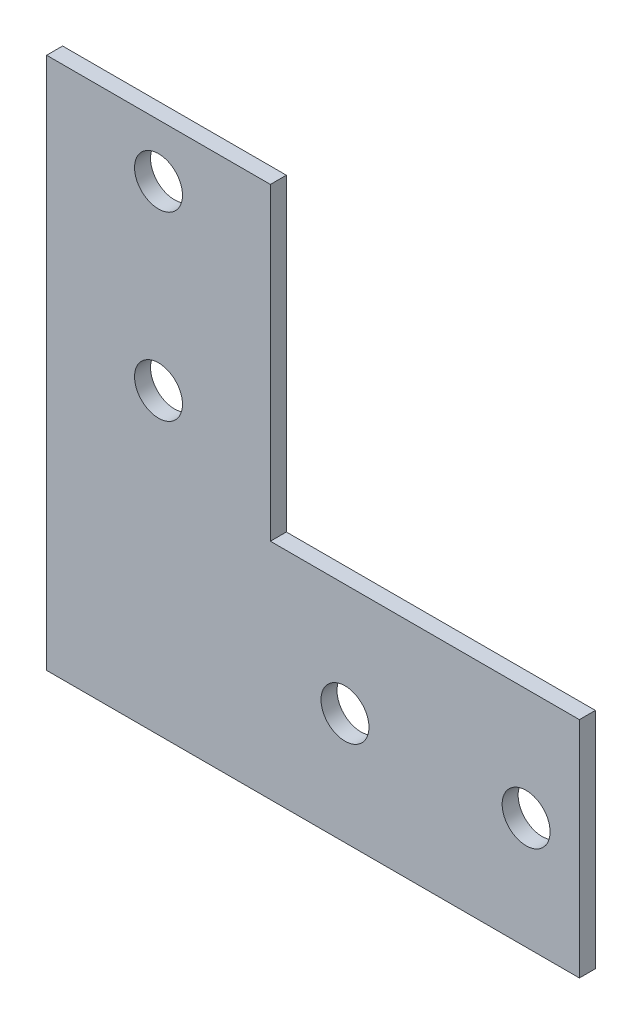
ISO-10303-21;
HEADER;
FILE_DESCRIPTION(('STEP AP214'),'2;1');
FILE_NAME('part.step','',(''),(''),'','','');
FILE_SCHEMA(('AUTOMOTIVE_DESIGN { 1 0 10303 214 1 1 1 1 }'));
ENDSEC;
DATA;
#1=APPLICATION_CONTEXT('core data for automotive mechanical design processes');
#2=APPLICATION_PROTOCOL_DEFINITION('international standard','automotive_design',2000,#1);
#3=PRODUCT_CONTEXT('',#1,'mechanical');
#4=PRODUCT('Part','Part','',(#3));
#5=PRODUCT_RELATED_PRODUCT_CATEGORY('part','',(#4));
#6=PRODUCT_DEFINITION_FORMATION('','',#4);
#7=PRODUCT_DEFINITION_CONTEXT('part definition',#1,'design');
#8=PRODUCT_DEFINITION('design','',#6,#7);
#9=PRODUCT_DEFINITION_SHAPE('','',#8);
#10=(LENGTH_UNIT() NAMED_UNIT(*) SI_UNIT(.MILLI.,.METRE.));
#11=(NAMED_UNIT(*) PLANE_ANGLE_UNIT() SI_UNIT($,.RADIAN.));
#12=(NAMED_UNIT(*) SI_UNIT($,.STERADIAN.) SOLID_ANGLE_UNIT());
#13=UNCERTAINTY_MEASURE_WITH_UNIT(LENGTH_MEASURE(1.E-05),#10,'distance_accuracy_value','');
#14=(GEOMETRIC_REPRESENTATION_CONTEXT(3) GLOBAL_UNCERTAINTY_ASSIGNED_CONTEXT((#13)) GLOBAL_UNIT_ASSIGNED_CONTEXT((#10,
#11,#12)) REPRESENTATION_CONTEXT('',''));
#15=CARTESIAN_POINT('',(0.,0.,0.));
#16=DIRECTION('',(0.,0.,1.));
#17=DIRECTION('',(1.,0.,0.));
#18=AXIS2_PLACEMENT_3D('',#15,#16,#17);
#19=CARTESIAN_POINT('',(0.,0.,3.));
#20=DIRECTION('',(0.,0.,1.));
#21=DIRECTION('',(1.,0.,0.));
#22=AXIS2_PLACEMENT_3D('',#19,#20,#21);
#23=PLANE('',#22);
#24=CARTESIAN_POINT('',(56.,21.,3.));
#25=DIRECTION('',(0.,0.,1.));
#26=DIRECTION('',(1.,0.,0.));
#27=AXIS2_PLACEMENT_3D('',#24,#25,#26);
#28=CIRCLE('',#27,4.5);
#29=CARTESIAN_POINT('',(60.5,21.,3.));
#30=VERTEX_POINT('',#29);
#31=EDGE_CURVE('E190',#30,#30,#28,.T.);
#32=ORIENTED_EDGE('',*,*,#31,.F.);
#33=EDGE_LOOP('',(#32));
#34=FACE_BOUND('',#33,.T.);
#35=CARTESIAN_POINT('',(21.,90.,3.));
#36=DIRECTION('',(0.,0.,1.));
#37=DIRECTION('',(1.,0.,0.));
#38=AXIS2_PLACEMENT_3D('',#35,#36,#37);
#39=CIRCLE('',#38,4.50000000000001);
#40=CARTESIAN_POINT('',(25.5,90.,3.));
#41=VERTEX_POINT('',#40);
#42=EDGE_CURVE('E123',#41,#41,#39,.T.);
#43=ORIENTED_EDGE('',*,*,#42,.F.);
#44=EDGE_LOOP('',(#43));
#45=FACE_BOUND('',#44,.T.);
#46=DIRECTION('',(-1.,0.,0.));
#47=VECTOR('',#46,1.);
#48=CARTESIAN_POINT('',(42.,100.,3.));
#49=LINE('',#48,#47);
#50=CARTESIAN_POINT('',(42.,100.,3.));
#51=VERTEX_POINT('',#50);
#52=CARTESIAN_POINT('',(0.,100.,3.));
#53=VERTEX_POINT('',#52);
#54=EDGE_CURVE('E130',#51,#53,#49,.T.);
#55=ORIENTED_EDGE('',*,*,#54,.T.);
#56=DIRECTION('',(0.,-1.,0.));
#57=VECTOR('',#56,1.);
#58=CARTESIAN_POINT('',(0.,100.,3.));
#59=LINE('',#58,#57);
#60=CARTESIAN_POINT('',(0.,0.,3.));
#61=VERTEX_POINT('',#60);
#62=EDGE_CURVE('E88',#53,#61,#59,.T.);
#63=ORIENTED_EDGE('',*,*,#62,.T.);
#64=DIRECTION('',(1.,0.,0.));
#65=VECTOR('',#64,1.);
#66=CARTESIAN_POINT('',(0.,0.,3.));
#67=LINE('',#66,#65);
#68=CARTESIAN_POINT('',(100.,0.,3.));
#69=VERTEX_POINT('',#68);
#70=EDGE_CURVE('E101',#61,#69,#67,.T.);
#71=ORIENTED_EDGE('',*,*,#70,.T.);
#72=DIRECTION('',(0.,1.,0.));
#73=VECTOR('',#72,1.);
#74=CARTESIAN_POINT('',(100.,0.,3.));
#75=LINE('',#74,#73);
#76=CARTESIAN_POINT('',(100.,42.,3.));
#77=VERTEX_POINT('',#76);
#78=EDGE_CURVE('E95',#69,#77,#75,.T.);
#79=ORIENTED_EDGE('',*,*,#78,.T.);
#80=DIRECTION('',(-1.,0.,0.));
#81=VECTOR('',#80,1.);
#82=CARTESIAN_POINT('',(100.,42.,3.));
#83=LINE('',#82,#81);
#84=CARTESIAN_POINT('',(42.,42.,3.));
#85=VERTEX_POINT('',#84);
#86=EDGE_CURVE('E99',#77,#85,#83,.T.);
#87=ORIENTED_EDGE('',*,*,#86,.T.);
#88=DIRECTION('',(0.,1.,0.));
#89=VECTOR('',#88,1.);
#90=CARTESIAN_POINT('',(42.,42.,3.));
#91=LINE('',#90,#89);
#92=EDGE_CURVE('E51',#85,#51,#91,.T.);
#93=ORIENTED_EDGE('',*,*,#92,.T.);
#94=EDGE_LOOP('',(#55,#63,#71,#79,#87,#93));
#95=FACE_BOUND('',#94,.T.);
#96=CARTESIAN_POINT('',(21.,56.,3.));
#97=DIRECTION('',(0.,0.,1.));
#98=DIRECTION('',(1.,0.,0.));
#99=AXIS2_PLACEMENT_3D('',#96,#97,#98);
#100=CIRCLE('',#99,4.50000000000001);
#101=CARTESIAN_POINT('',(25.5,56.,3.));
#102=VERTEX_POINT('',#101);
#103=EDGE_CURVE('E196',#102,#102,#100,.T.);
#104=ORIENTED_EDGE('',*,*,#103,.F.);
#105=EDGE_LOOP('',(#104));
#106=FACE_BOUND('',#105,.T.);
#107=CARTESIAN_POINT('',(90.,21.,3.));
#108=DIRECTION('',(0.,0.,1.));
#109=DIRECTION('',(1.,0.,0.));
#110=AXIS2_PLACEMENT_3D('',#107,#108,#109);
#111=CIRCLE('',#110,4.5);
#112=CARTESIAN_POINT('',(94.5,21.,3.));
#113=VERTEX_POINT('',#112);
#114=EDGE_CURVE('E181',#113,#113,#111,.T.);
#115=ORIENTED_EDGE('',*,*,#114,.F.);
#116=EDGE_LOOP('',(#115));
#117=FACE_BOUND('',#116,.T.);
#118=ADVANCED_FACE('F34',(#34,#45,#95,#106,#117),#23,.T.);
#119=CARTESIAN_POINT('',(0.,0.,0.));
#120=DIRECTION('',(0.,0.,1.));
#121=DIRECTION('',(1.,0.,0.));
#122=AXIS2_PLACEMENT_3D('',#119,#120,#121);
#123=PLANE('',#122);
#124=DIRECTION('',(-1.,0.,0.));
#125=VECTOR('',#124,1.);
#126=CARTESIAN_POINT('',(42.,100.,0.));
#127=LINE('',#126,#125);
#128=CARTESIAN_POINT('',(42.,100.,0.));
#129=VERTEX_POINT('',#128);
#130=CARTESIAN_POINT('',(0.,100.,0.));
#131=VERTEX_POINT('',#130);
#132=EDGE_CURVE('E119',#129,#131,#127,.T.);
#133=ORIENTED_EDGE('',*,*,#132,.F.);
#134=DIRECTION('',(0.,1.,0.));
#135=VECTOR('',#134,1.);
#136=CARTESIAN_POINT('',(42.,42.,0.));
#137=LINE('',#136,#135);
#138=CARTESIAN_POINT('',(42.,42.,0.));
#139=VERTEX_POINT('',#138);
#140=EDGE_CURVE('E80',#139,#129,#137,.T.);
#141=ORIENTED_EDGE('',*,*,#140,.F.);
#142=DIRECTION('',(-1.,0.,0.));
#143=VECTOR('',#142,1.);
#144=CARTESIAN_POINT('',(100.,42.,0.));
#145=LINE('',#144,#143);
#146=CARTESIAN_POINT('',(100.,42.,0.));
#147=VERTEX_POINT('',#146);
#148=EDGE_CURVE('E74',#147,#139,#145,.T.);
#149=ORIENTED_EDGE('',*,*,#148,.F.);
#150=DIRECTION('',(0.,1.,0.));
#151=VECTOR('',#150,1.);
#152=CARTESIAN_POINT('',(100.,0.,0.));
#153=LINE('',#152,#151);
#154=CARTESIAN_POINT('',(100.,0.,0.));
#155=VERTEX_POINT('',#154);
#156=EDGE_CURVE('E109',#155,#147,#153,.T.);
#157=ORIENTED_EDGE('',*,*,#156,.F.);
#158=DIRECTION('',(1.,0.,0.));
#159=VECTOR('',#158,1.);
#160=CARTESIAN_POINT('',(0.,0.,0.));
#161=LINE('',#160,#159);
#162=CARTESIAN_POINT('',(0.,0.,0.));
#163=VERTEX_POINT('',#162);
#164=EDGE_CURVE('E125',#163,#155,#161,.T.);
#165=ORIENTED_EDGE('',*,*,#164,.F.);
#166=DIRECTION('',(0.,-1.,0.));
#167=VECTOR('',#166,1.);
#168=CARTESIAN_POINT('',(0.,100.,0.));
#169=LINE('',#168,#167);
#170=EDGE_CURVE('E122',#131,#163,#169,.T.);
#171=ORIENTED_EDGE('',*,*,#170,.F.);
#172=EDGE_LOOP('',(#133,#141,#149,#157,#165,#171));
#173=FACE_BOUND('',#172,.T.);
#174=CARTESIAN_POINT('',(21.,90.,0.));
#175=DIRECTION('',(0.,0.,1.));
#176=DIRECTION('',(1.,0.,0.));
#177=AXIS2_PLACEMENT_3D('',#174,#175,#176);
#178=CIRCLE('',#177,4.50000000000001);
#179=CARTESIAN_POINT('',(25.5,90.,0.));
#180=VERTEX_POINT('',#179);
#181=EDGE_CURVE('E199',#180,#180,#178,.T.);
#182=ORIENTED_EDGE('',*,*,#181,.T.);
#183=EDGE_LOOP('',(#182));
#184=FACE_BOUND('',#183,.T.);
#185=CARTESIAN_POINT('',(21.,56.,0.));
#186=DIRECTION('',(0.,0.,1.));
#187=DIRECTION('',(1.,0.,0.));
#188=AXIS2_PLACEMENT_3D('',#185,#186,#187);
#189=CIRCLE('',#188,4.50000000000001);
#190=CARTESIAN_POINT('',(25.5,56.,0.));
#191=VERTEX_POINT('',#190);
#192=EDGE_CURVE('E193',#191,#191,#189,.T.);
#193=ORIENTED_EDGE('',*,*,#192,.T.);
#194=EDGE_LOOP('',(#193));
#195=FACE_BOUND('',#194,.T.);
#196=CARTESIAN_POINT('',(56.,21.,0.));
#197=DIRECTION('',(0.,0.,1.));
#198=DIRECTION('',(1.,0.,0.));
#199=AXIS2_PLACEMENT_3D('',#196,#197,#198);
#200=CIRCLE('',#199,4.5);
#201=CARTESIAN_POINT('',(60.5,21.,0.));
#202=VERTEX_POINT('',#201);
#203=EDGE_CURVE('E187',#202,#202,#200,.T.);
#204=ORIENTED_EDGE('',*,*,#203,.T.);
#205=EDGE_LOOP('',(#204));
#206=FACE_BOUND('',#205,.T.);
#207=CARTESIAN_POINT('',(90.,21.,0.));
#208=DIRECTION('',(0.,0.,1.));
#209=DIRECTION('',(1.,0.,0.));
#210=AXIS2_PLACEMENT_3D('',#207,#208,#209);
#211=CIRCLE('',#210,4.5);
#212=CARTESIAN_POINT('',(94.5,21.,0.));
#213=VERTEX_POINT('',#212);
#214=EDGE_CURVE('E184',#213,#213,#211,.T.);
#215=ORIENTED_EDGE('',*,*,#214,.T.);
#216=EDGE_LOOP('',(#215));
#217=FACE_BOUND('',#216,.T.);
#218=ADVANCED_FACE('F139',(#173,#184,#195,#206,#217),#123,.F.);
#219=CARTESIAN_POINT('',(42.,100.,3.));
#220=DIRECTION('',(0.,-1.,0.));
#221=DIRECTION('',(0.,0.,-1.));
#222=AXIS2_PLACEMENT_3D('',#219,#220,#221);
#223=PLANE('',#222);
#224=ORIENTED_EDGE('',*,*,#132,.T.);
#225=DIRECTION('',(0.,0.,-1.));
#226=VECTOR('',#225,1.);
#227=CARTESIAN_POINT('',(0.,100.,3.));
#228=LINE('',#227,#226);
#229=EDGE_CURVE('E11',#53,#131,#228,.T.);
#230=ORIENTED_EDGE('',*,*,#229,.F.);
#231=ORIENTED_EDGE('',*,*,#54,.F.);
#232=DIRECTION('',(0.,0.,-1.));
#233=VECTOR('',#232,1.);
#234=CARTESIAN_POINT('',(42.,100.,3.));
#235=LINE('',#234,#233);
#236=EDGE_CURVE('E115',#51,#129,#235,.T.);
#237=ORIENTED_EDGE('',*,*,#236,.T.);
#238=EDGE_LOOP('',(#224,#230,#231,#237));
#239=FACE_BOUND('',#238,.T.);
#240=ADVANCED_FACE('F36',(#239),#223,.F.);
#241=CARTESIAN_POINT('',(0.,100.,3.));
#242=DIRECTION('',(1.,0.,0.));
#243=DIRECTION('',(0.,1.,0.));
#244=AXIS2_PLACEMENT_3D('',#241,#242,#243);
#245=PLANE('',#244);
#246=ORIENTED_EDGE('',*,*,#170,.T.);
#247=DIRECTION('',(0.,0.,-1.));
#248=VECTOR('',#247,1.);
#249=CARTESIAN_POINT('',(0.,0.,3.));
#250=LINE('',#249,#248);
#251=EDGE_CURVE('E43',#61,#163,#250,.T.);
#252=ORIENTED_EDGE('',*,*,#251,.F.);
#253=ORIENTED_EDGE('',*,*,#62,.F.);
#254=ORIENTED_EDGE('',*,*,#229,.T.);
#255=EDGE_LOOP('',(#246,#252,#253,#254));
#256=FACE_BOUND('',#255,.T.);
#257=ADVANCED_FACE('F257',(#256),#245,.F.);
#258=CARTESIAN_POINT('',(0.,0.,3.));
#259=DIRECTION('',(0.,1.,0.));
#260=DIRECTION('',(0.,0.,1.));
#261=AXIS2_PLACEMENT_3D('',#258,#259,#260);
#262=PLANE('',#261);
#263=ORIENTED_EDGE('',*,*,#164,.T.);
#264=DIRECTION('',(0.,0.,-1.));
#265=VECTOR('',#264,1.);
#266=CARTESIAN_POINT('',(100.,0.,3.));
#267=LINE('',#266,#265);
#268=EDGE_CURVE('E110',#69,#155,#267,.T.);
#269=ORIENTED_EDGE('',*,*,#268,.F.);
#270=ORIENTED_EDGE('',*,*,#70,.F.);
#271=ORIENTED_EDGE('',*,*,#251,.T.);
#272=EDGE_LOOP('',(#263,#269,#270,#271));
#273=FACE_BOUND('',#272,.T.);
#274=ADVANCED_FACE('F136',(#273),#262,.F.);
#275=CARTESIAN_POINT('',(100.,0.,3.));
#276=DIRECTION('',(-1.,0.,0.));
#277=DIRECTION('',(0.,0.,1.));
#278=AXIS2_PLACEMENT_3D('',#275,#276,#277);
#279=PLANE('',#278);
#280=ORIENTED_EDGE('',*,*,#156,.T.);
#281=DIRECTION('',(0.,0.,-1.));
#282=VECTOR('',#281,1.);
#283=CARTESIAN_POINT('',(100.,42.,3.));
#284=LINE('',#283,#282);
#285=EDGE_CURVE('E106',#77,#147,#284,.T.);
#286=ORIENTED_EDGE('',*,*,#285,.F.);
#287=ORIENTED_EDGE('',*,*,#78,.F.);
#288=ORIENTED_EDGE('',*,*,#268,.T.);
#289=EDGE_LOOP('',(#280,#286,#287,#288));
#290=FACE_BOUND('',#289,.T.);
#291=ADVANCED_FACE('F107',(#290),#279,.F.);
#292=CARTESIAN_POINT('',(100.,42.,3.));
#293=DIRECTION('',(0.,-1.,0.));
#294=DIRECTION('',(1.,0.,0.));
#295=AXIS2_PLACEMENT_3D('',#292,#293,#294);
#296=PLANE('',#295);
#297=ORIENTED_EDGE('',*,*,#148,.T.);
#298=DIRECTION('',(0.,0.,-1.));
#299=VECTOR('',#298,1.);
#300=CARTESIAN_POINT('',(42.,42.,3.));
#301=LINE('',#300,#299);
#302=EDGE_CURVE('E111',#85,#139,#301,.T.);
#303=ORIENTED_EDGE('',*,*,#302,.F.);
#304=ORIENTED_EDGE('',*,*,#86,.F.);
#305=ORIENTED_EDGE('',*,*,#285,.T.);
#306=EDGE_LOOP('',(#297,#303,#304,#305));
#307=FACE_BOUND('',#306,.T.);
#308=ADVANCED_FACE('F113',(#307),#296,.F.);
#309=CARTESIAN_POINT('',(42.,42.,3.));
#310=DIRECTION('',(-1.,0.,0.));
#311=DIRECTION('',(0.,-1.,0.));
#312=AXIS2_PLACEMENT_3D('',#309,#310,#311);
#313=PLANE('',#312);
#314=ORIENTED_EDGE('',*,*,#140,.T.);
#315=ORIENTED_EDGE('',*,*,#236,.F.);
#316=ORIENTED_EDGE('',*,*,#92,.F.);
#317=ORIENTED_EDGE('',*,*,#302,.T.);
#318=EDGE_LOOP('',(#314,#315,#316,#317));
#319=FACE_BOUND('',#318,.T.);
#320=ADVANCED_FACE('F144',(#319),#313,.F.);
#321=CARTESIAN_POINT('',(21.,90.,3.));
#322=DIRECTION('',(0.,0.,-1.));
#323=DIRECTION('',(-1.,0.,0.));
#324=AXIS2_PLACEMENT_3D('',#321,#322,#323);
#325=CYLINDRICAL_SURFACE('',#324,4.50000000000001);
#326=ORIENTED_EDGE('',*,*,#42,.T.);
#327=EDGE_LOOP('',(#326));
#328=FACE_BOUND('',#327,.T.);
#329=ORIENTED_EDGE('',*,*,#181,.F.);
#330=EDGE_LOOP('',(#329));
#331=FACE_BOUND('',#330,.T.);
#332=ADVANCED_FACE('F146',(#328,#331),#325,.F.);
#333=CARTESIAN_POINT('',(21.,56.,3.));
#334=DIRECTION('',(0.,0.,-1.));
#335=DIRECTION('',(-1.,0.,0.));
#336=AXIS2_PLACEMENT_3D('',#333,#334,#335);
#337=CYLINDRICAL_SURFACE('',#336,4.50000000000001);
#338=ORIENTED_EDGE('',*,*,#103,.T.);
#339=EDGE_LOOP('',(#338));
#340=FACE_BOUND('',#339,.T.);
#341=ORIENTED_EDGE('',*,*,#192,.F.);
#342=EDGE_LOOP('',(#341));
#343=FACE_BOUND('',#342,.T.);
#344=ADVANCED_FACE('F152',(#340,#343),#337,.F.);
#345=CARTESIAN_POINT('',(56.,21.,3.));
#346=DIRECTION('',(0.,0.,-1.));
#347=DIRECTION('',(-1.,0.,0.));
#348=AXIS2_PLACEMENT_3D('',#345,#346,#347);
#349=CYLINDRICAL_SURFACE('',#348,4.5);
#350=ORIENTED_EDGE('',*,*,#31,.T.);
#351=EDGE_LOOP('',(#350));
#352=FACE_BOUND('',#351,.T.);
#353=ORIENTED_EDGE('',*,*,#203,.F.);
#354=EDGE_LOOP('',(#353));
#355=FACE_BOUND('',#354,.T.);
#356=ADVANCED_FACE('F168',(#352,#355),#349,.F.);
#357=CARTESIAN_POINT('',(90.,21.,3.));
#358=DIRECTION('',(0.,0.,-1.));
#359=DIRECTION('',(-1.,0.,0.));
#360=AXIS2_PLACEMENT_3D('',#357,#358,#359);
#361=CYLINDRICAL_SURFACE('',#360,4.5);
#362=ORIENTED_EDGE('',*,*,#114,.T.);
#363=EDGE_LOOP('',(#362));
#364=FACE_BOUND('',#363,.T.);
#365=ORIENTED_EDGE('',*,*,#214,.F.);
#366=EDGE_LOOP('',(#365));
#367=FACE_BOUND('',#366,.T.);
#368=ADVANCED_FACE('F172',(#364,#367),#361,.F.);
#369=CLOSED_SHELL('',(#118,#218,#240,#257,#274,#291,#308,#320,#332,#344,#356,#368));
#370=MANIFOLD_SOLID_BREP('B2',#369);
#371=ADVANCED_BREP_SHAPE_REPRESENTATION('',(#18,#370),#14);
#372=SHAPE_DEFINITION_REPRESENTATION(#9,#371);
ENDSEC;
END-ISO-10303-21;
